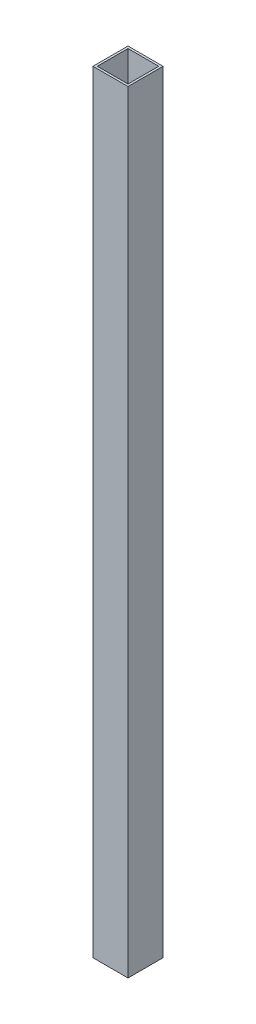
ISO-10303-21;
HEADER;
FILE_DESCRIPTION(('STEP AP214'),'2;1');
FILE_NAME('part.step','',(''),(''),'','','');
FILE_SCHEMA(('AUTOMOTIVE_DESIGN { 1 0 10303 214 1 1 1 1 }'));
ENDSEC;
DATA;
#1=APPLICATION_CONTEXT('core data for automotive mechanical design processes');
#2=APPLICATION_PROTOCOL_DEFINITION('international standard','automotive_design',2000,#1);
#3=PRODUCT_CONTEXT('',#1,'mechanical');
#4=PRODUCT('Part','Part','',(#3));
#5=PRODUCT_RELATED_PRODUCT_CATEGORY('part','',(#4));
#6=PRODUCT_DEFINITION_FORMATION('','',#4);
#7=PRODUCT_DEFINITION_CONTEXT('part definition',#1,'design');
#8=PRODUCT_DEFINITION('design','',#6,#7);
#9=PRODUCT_DEFINITION_SHAPE('','',#8);
#10=(LENGTH_UNIT() NAMED_UNIT(*) SI_UNIT(.MILLI.,.METRE.));
#11=(NAMED_UNIT(*) PLANE_ANGLE_UNIT() SI_UNIT($,.RADIAN.));
#12=(NAMED_UNIT(*) SI_UNIT($,.STERADIAN.) SOLID_ANGLE_UNIT());
#13=UNCERTAINTY_MEASURE_WITH_UNIT(LENGTH_MEASURE(1.E-05),#10,'distance_accuracy_value','');
#14=(GEOMETRIC_REPRESENTATION_CONTEXT(3) GLOBAL_UNCERTAINTY_ASSIGNED_CONTEXT((#13)) GLOBAL_UNIT_ASSIGNED_CONTEXT((#10,
#11,#12)) REPRESENTATION_CONTEXT('',''));
#15=CARTESIAN_POINT('',(0.,0.,0.));
#16=DIRECTION('',(0.,0.,1.));
#17=DIRECTION('',(1.,0.,0.));
#18=AXIS2_PLACEMENT_3D('',#15,#16,#17);
#19=CARTESIAN_POINT('',(0.,558.8,0.));
#20=DIRECTION('',(0.,-1.,0.));
#21=DIRECTION('',(0.,0.,-1.));
#22=AXIS2_PLACEMENT_3D('',#19,#20,#21);
#23=PLANE('',#22);
#24=DIRECTION('',(0.,0.,-1.));
#25=VECTOR('',#24,1.);
#26=CARTESIAN_POINT('',(12.7,558.8,12.7));
#27=LINE('',#26,#25);
#28=CARTESIAN_POINT('',(12.7,558.8,12.7));
#29=VERTEX_POINT('',#28);
#30=CARTESIAN_POINT('',(12.7,558.8,-12.7));
#31=VERTEX_POINT('',#30);
#32=EDGE_CURVE('E134',#29,#31,#27,.T.);
#33=ORIENTED_EDGE('',*,*,#32,.T.);
#34=DIRECTION('',(-1.,0.,0.));
#35=VECTOR('',#34,1.);
#36=CARTESIAN_POINT('',(-12.7,558.8,-12.7));
#37=LINE('',#36,#35);
#38=CARTESIAN_POINT('',(-12.7,558.8,-12.7));
#39=VERTEX_POINT('',#38);
#40=EDGE_CURVE('E137',#31,#39,#37,.T.);
#41=ORIENTED_EDGE('',*,*,#40,.T.);
#42=DIRECTION('',(0.,0.,1.));
#43=VECTOR('',#42,1.);
#44=CARTESIAN_POINT('',(-12.7,558.8,12.7));
#45=LINE('',#44,#43);
#46=CARTESIAN_POINT('',(-12.7,558.8,12.7));
#47=VERTEX_POINT('',#46);
#48=EDGE_CURVE('E140',#39,#47,#45,.T.);
#49=ORIENTED_EDGE('',*,*,#48,.T.);
#50=DIRECTION('',(1.,0.,0.));
#51=VECTOR('',#50,1.);
#52=CARTESIAN_POINT('',(-12.7,558.8,12.7));
#53=LINE('',#52,#51);
#54=EDGE_CURVE('E142',#47,#29,#53,.T.);
#55=ORIENTED_EDGE('',*,*,#54,.T.);
#56=EDGE_LOOP('',(#33,#41,#49,#55));
#57=FACE_BOUND('',#56,.T.);
#58=DIRECTION('',(0.,0.,-1.));
#59=VECTOR('',#58,1.);
#60=CARTESIAN_POINT('',(11.1125,558.8,11.1125));
#61=LINE('',#60,#59);
#62=CARTESIAN_POINT('',(11.1125,558.8,11.1125));
#63=VERTEX_POINT('',#62);
#64=CARTESIAN_POINT('',(11.1125,558.8,-11.1125));
#65=VERTEX_POINT('',#64);
#66=EDGE_CURVE('E98',#63,#65,#61,.T.);
#67=ORIENTED_EDGE('',*,*,#66,.F.);
#68=DIRECTION('',(1.,0.,0.));
#69=VECTOR('',#68,1.);
#70=CARTESIAN_POINT('',(-11.1125,558.8,11.1125));
#71=LINE('',#70,#69);
#72=CARTESIAN_POINT('',(-11.1125,558.8,11.1125));
#73=VERTEX_POINT('',#72);
#74=EDGE_CURVE('E120',#73,#63,#71,.T.);
#75=ORIENTED_EDGE('',*,*,#74,.F.);
#76=DIRECTION('',(0.,0.,1.));
#77=VECTOR('',#76,1.);
#78=CARTESIAN_POINT('',(-11.1125,558.8,11.1125));
#79=LINE('',#78,#77);
#80=CARTESIAN_POINT('',(-11.1125,558.8,-11.1125));
#81=VERTEX_POINT('',#80);
#82=EDGE_CURVE('E118',#81,#73,#79,.T.);
#83=ORIENTED_EDGE('',*,*,#82,.F.);
#84=DIRECTION('',(-1.,0.,0.));
#85=VECTOR('',#84,1.);
#86=CARTESIAN_POINT('',(-11.1125,558.8,-11.1125));
#87=LINE('',#86,#85);
#88=EDGE_CURVE('E106',#65,#81,#87,.T.);
#89=ORIENTED_EDGE('',*,*,#88,.F.);
#90=EDGE_LOOP('',(#67,#75,#83,#89));
#91=FACE_BOUND('',#90,.T.);
#92=ADVANCED_FACE('F33',(#57,#91),#23,.F.);
#93=CARTESIAN_POINT('',(0.,0.,0.));
#94=DIRECTION('',(0.,-1.,0.));
#95=DIRECTION('',(0.,0.,-1.));
#96=AXIS2_PLACEMENT_3D('',#93,#94,#95);
#97=PLANE('',#96);
#98=DIRECTION('',(0.,0.,-1.));
#99=VECTOR('',#98,1.);
#100=CARTESIAN_POINT('',(12.7,0.,12.7));
#101=LINE('',#100,#99);
#102=CARTESIAN_POINT('',(12.7,0.,12.7));
#103=VERTEX_POINT('',#102);
#104=CARTESIAN_POINT('',(12.7,0.,-12.7));
#105=VERTEX_POINT('',#104);
#106=EDGE_CURVE('E114',#103,#105,#101,.T.);
#107=ORIENTED_EDGE('',*,*,#106,.F.);
#108=DIRECTION('',(1.,0.,0.));
#109=VECTOR('',#108,1.);
#110=CARTESIAN_POINT('',(-12.7,0.,12.7));
#111=LINE('',#110,#109);
#112=CARTESIAN_POINT('',(-12.7,0.,12.7));
#113=VERTEX_POINT('',#112);
#114=EDGE_CURVE('E138',#113,#103,#111,.T.);
#115=ORIENTED_EDGE('',*,*,#114,.F.);
#116=DIRECTION('',(0.,0.,1.));
#117=VECTOR('',#116,1.);
#118=CARTESIAN_POINT('',(-12.7,0.,12.7));
#119=LINE('',#118,#117);
#120=CARTESIAN_POINT('',(-12.7,0.,-12.7));
#121=VERTEX_POINT('',#120);
#122=EDGE_CURVE('E149',#121,#113,#119,.T.);
#123=ORIENTED_EDGE('',*,*,#122,.F.);
#124=DIRECTION('',(-1.,0.,0.));
#125=VECTOR('',#124,1.);
#126=CARTESIAN_POINT('',(-12.7,0.,-12.7));
#127=LINE('',#126,#125);
#128=EDGE_CURVE('E147',#105,#121,#127,.T.);
#129=ORIENTED_EDGE('',*,*,#128,.F.);
#130=EDGE_LOOP('',(#107,#115,#123,#129));
#131=FACE_BOUND('',#130,.T.);
#132=DIRECTION('',(1.,0.,0.));
#133=VECTOR('',#132,1.);
#134=CARTESIAN_POINT('',(-11.1125,0.,11.1125));
#135=LINE('',#134,#133);
#136=CARTESIAN_POINT('',(-11.1125,0.,11.1125));
#137=VERTEX_POINT('',#136);
#138=CARTESIAN_POINT('',(11.1125,0.,11.1125));
#139=VERTEX_POINT('',#138);
#140=EDGE_CURVE('E107',#137,#139,#135,.T.);
#141=ORIENTED_EDGE('',*,*,#140,.T.);
#142=DIRECTION('',(0.,0.,-1.));
#143=VECTOR('',#142,1.);
#144=CARTESIAN_POINT('',(11.1125,0.,11.1125));
#145=LINE('',#144,#143);
#146=CARTESIAN_POINT('',(11.1125,0.,-11.1125));
#147=VERTEX_POINT('',#146);
#148=EDGE_CURVE('E56',#139,#147,#145,.T.);
#149=ORIENTED_EDGE('',*,*,#148,.T.);
#150=DIRECTION('',(-1.,0.,0.));
#151=VECTOR('',#150,1.);
#152=CARTESIAN_POINT('',(-11.1125,0.,-11.1125));
#153=LINE('',#152,#151);
#154=CARTESIAN_POINT('',(-11.1125,0.,-11.1125));
#155=VERTEX_POINT('',#154);
#156=EDGE_CURVE('E113',#147,#155,#153,.T.);
#157=ORIENTED_EDGE('',*,*,#156,.T.);
#158=DIRECTION('',(0.,0.,1.));
#159=VECTOR('',#158,1.);
#160=CARTESIAN_POINT('',(-11.1125,0.,11.1125));
#161=LINE('',#160,#159);
#162=EDGE_CURVE('E126',#155,#137,#161,.T.);
#163=ORIENTED_EDGE('',*,*,#162,.T.);
#164=EDGE_LOOP('',(#141,#149,#157,#163));
#165=FACE_BOUND('',#164,.T.);
#166=ADVANCED_FACE('F167',(#131,#165),#97,.T.);
#167=CARTESIAN_POINT('',(12.7,558.8,12.7));
#168=DIRECTION('',(-1.,0.,0.));
#169=DIRECTION('',(0.,0.,1.));
#170=AXIS2_PLACEMENT_3D('',#167,#168,#169);
#171=PLANE('',#170);
#172=ORIENTED_EDGE('',*,*,#106,.T.);
#173=DIRECTION('',(0.,-1.,0.));
#174=VECTOR('',#173,1.);
#175=CARTESIAN_POINT('',(12.7,558.8,-12.7));
#176=LINE('',#175,#174);
#177=EDGE_CURVE('E11',#31,#105,#176,.T.);
#178=ORIENTED_EDGE('',*,*,#177,.F.);
#179=ORIENTED_EDGE('',*,*,#32,.F.);
#180=DIRECTION('',(0.,-1.,0.));
#181=VECTOR('',#180,1.);
#182=CARTESIAN_POINT('',(12.7,558.8,12.7));
#183=LINE('',#182,#181);
#184=EDGE_CURVE('E144',#29,#103,#183,.T.);
#185=ORIENTED_EDGE('',*,*,#184,.T.);
#186=EDGE_LOOP('',(#172,#178,#179,#185));
#187=FACE_BOUND('',#186,.T.);
#188=ADVANCED_FACE('F35',(#187),#171,.F.);
#189=CARTESIAN_POINT('',(-12.7,558.8,-12.7));
#190=DIRECTION('',(0.,0.,1.));
#191=DIRECTION('',(1.,0.,0.));
#192=AXIS2_PLACEMENT_3D('',#189,#190,#191);
#193=PLANE('',#192);
#194=ORIENTED_EDGE('',*,*,#128,.T.);
#195=DIRECTION('',(0.,-1.,0.));
#196=VECTOR('',#195,1.);
#197=CARTESIAN_POINT('',(-12.7,558.8,-12.7));
#198=LINE('',#197,#196);
#199=EDGE_CURVE('E41',#39,#121,#198,.T.);
#200=ORIENTED_EDGE('',*,*,#199,.F.);
#201=ORIENTED_EDGE('',*,*,#40,.F.);
#202=ORIENTED_EDGE('',*,*,#177,.T.);
#203=EDGE_LOOP('',(#194,#200,#201,#202));
#204=FACE_BOUND('',#203,.T.);
#205=ADVANCED_FACE('F177',(#204),#193,.F.);
#206=CARTESIAN_POINT('',(-12.7,558.8,12.7));
#207=DIRECTION('',(1.,0.,0.));
#208=DIRECTION('',(0.,0.,-1.));
#209=AXIS2_PLACEMENT_3D('',#206,#207,#208);
#210=PLANE('',#209);
#211=ORIENTED_EDGE('',*,*,#122,.T.);
#212=DIRECTION('',(0.,-1.,0.));
#213=VECTOR('',#212,1.);
#214=CARTESIAN_POINT('',(-12.7,558.8,12.7));
#215=LINE('',#214,#213);
#216=EDGE_CURVE('E154',#47,#113,#215,.T.);
#217=ORIENTED_EDGE('',*,*,#216,.F.);
#218=ORIENTED_EDGE('',*,*,#48,.F.);
#219=ORIENTED_EDGE('',*,*,#199,.T.);
#220=EDGE_LOOP('',(#211,#217,#218,#219));
#221=FACE_BOUND('',#220,.T.);
#222=ADVANCED_FACE('F161',(#221),#210,.F.);
#223=CARTESIAN_POINT('',(-12.7,558.8,12.7));
#224=DIRECTION('',(0.,0.,-1.));
#225=DIRECTION('',(-1.,0.,0.));
#226=AXIS2_PLACEMENT_3D('',#223,#224,#225);
#227=PLANE('',#226);
#228=ORIENTED_EDGE('',*,*,#114,.T.);
#229=ORIENTED_EDGE('',*,*,#184,.F.);
#230=ORIENTED_EDGE('',*,*,#54,.F.);
#231=ORIENTED_EDGE('',*,*,#216,.T.);
#232=EDGE_LOOP('',(#228,#229,#230,#231));
#233=FACE_BOUND('',#232,.T.);
#234=ADVANCED_FACE('F171',(#233),#227,.F.);
#235=CARTESIAN_POINT('',(11.1125,558.8,11.1125));
#236=DIRECTION('',(-1.,0.,0.));
#237=DIRECTION('',(0.,0.,1.));
#238=AXIS2_PLACEMENT_3D('',#235,#236,#237);
#239=PLANE('',#238);
#240=ORIENTED_EDGE('',*,*,#148,.F.);
#241=DIRECTION('',(0.,-1.,0.));
#242=VECTOR('',#241,1.);
#243=CARTESIAN_POINT('',(11.1125,558.8,11.1125));
#244=LINE('',#243,#242);
#245=EDGE_CURVE('E102',#63,#139,#244,.T.);
#246=ORIENTED_EDGE('',*,*,#245,.F.);
#247=ORIENTED_EDGE('',*,*,#66,.T.);
#248=DIRECTION('',(0.,-1.,0.));
#249=VECTOR('',#248,1.);
#250=CARTESIAN_POINT('',(11.1125,558.8,-11.1125));
#251=LINE('',#250,#249);
#252=EDGE_CURVE('E101',#65,#147,#251,.T.);
#253=ORIENTED_EDGE('',*,*,#252,.T.);
#254=EDGE_LOOP('',(#240,#246,#247,#253));
#255=FACE_BOUND('',#254,.T.);
#256=ADVANCED_FACE('F100',(#255),#239,.T.);
#257=CARTESIAN_POINT('',(-11.1125,558.8,-11.1125));
#258=DIRECTION('',(0.,0.,1.));
#259=DIRECTION('',(1.,0.,0.));
#260=AXIS2_PLACEMENT_3D('',#257,#258,#259);
#261=PLANE('',#260);
#262=ORIENTED_EDGE('',*,*,#156,.F.);
#263=ORIENTED_EDGE('',*,*,#252,.F.);
#264=ORIENTED_EDGE('',*,*,#88,.T.);
#265=DIRECTION('',(0.,-1.,0.));
#266=VECTOR('',#265,1.);
#267=CARTESIAN_POINT('',(-11.1125,558.8,-11.1125));
#268=LINE('',#267,#266);
#269=EDGE_CURVE('E115',#81,#155,#268,.T.);
#270=ORIENTED_EDGE('',*,*,#269,.T.);
#271=EDGE_LOOP('',(#262,#263,#264,#270));
#272=FACE_BOUND('',#271,.T.);
#273=ADVANCED_FACE('F110',(#272),#261,.T.);
#274=CARTESIAN_POINT('',(-11.1125,558.8,11.1125));
#275=DIRECTION('',(1.,0.,0.));
#276=DIRECTION('',(0.,0.,-1.));
#277=AXIS2_PLACEMENT_3D('',#274,#275,#276);
#278=PLANE('',#277);
#279=ORIENTED_EDGE('',*,*,#162,.F.);
#280=ORIENTED_EDGE('',*,*,#269,.F.);
#281=ORIENTED_EDGE('',*,*,#82,.T.);
#282=DIRECTION('',(0.,-1.,0.));
#283=VECTOR('',#282,1.);
#284=CARTESIAN_POINT('',(-11.1125,558.8,11.1125));
#285=LINE('',#284,#283);
#286=EDGE_CURVE('E48',#73,#137,#285,.T.);
#287=ORIENTED_EDGE('',*,*,#286,.T.);
#288=EDGE_LOOP('',(#279,#280,#281,#287));
#289=FACE_BOUND('',#288,.T.);
#290=ADVANCED_FACE('F200',(#289),#278,.T.);
#291=CARTESIAN_POINT('',(-11.1125,558.8,11.1125));
#292=DIRECTION('',(0.,0.,-1.));
#293=DIRECTION('',(-1.,0.,0.));
#294=AXIS2_PLACEMENT_3D('',#291,#292,#293);
#295=PLANE('',#294);
#296=ORIENTED_EDGE('',*,*,#140,.F.);
#297=ORIENTED_EDGE('',*,*,#286,.F.);
#298=ORIENTED_EDGE('',*,*,#74,.T.);
#299=ORIENTED_EDGE('',*,*,#245,.T.);
#300=EDGE_LOOP('',(#296,#297,#298,#299));
#301=FACE_BOUND('',#300,.T.);
#302=ADVANCED_FACE('F204',(#301),#295,.T.);
#303=CLOSED_SHELL('',(#92,#166,#188,#205,#222,#234,#256,#273,#290,#302));
#304=MANIFOLD_SOLID_BREP('B2',#303);
#305=ADVANCED_BREP_SHAPE_REPRESENTATION('',(#18,#304),#14);
#306=SHAPE_DEFINITION_REPRESENTATION(#9,#305);
ENDSEC;
END-ISO-10303-21;
